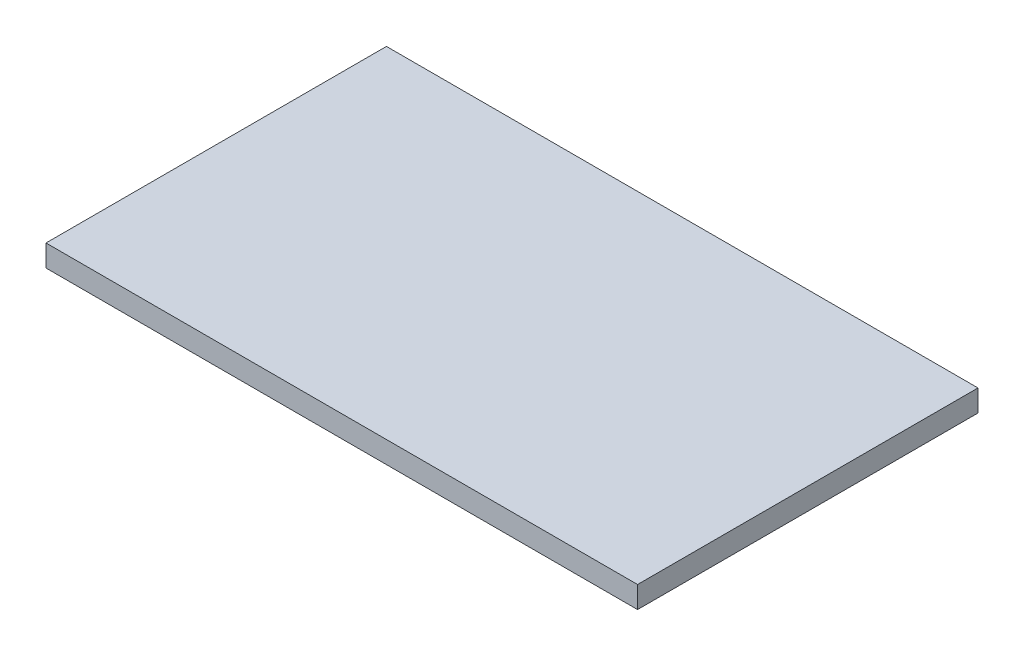
ISO-10303-21;
HEADER;
FILE_DESCRIPTION(('STEP AP214'),'2;1');
FILE_NAME('part.step','',(''),(''),'','','');
FILE_SCHEMA(('AUTOMOTIVE_DESIGN { 1 0 10303 214 1 1 1 1 }'));
ENDSEC;
DATA;
#1=APPLICATION_CONTEXT('core data for automotive mechanical design processes');
#2=APPLICATION_PROTOCOL_DEFINITION('international standard','automotive_design',2000,#1);
#3=PRODUCT_CONTEXT('',#1,'mechanical');
#4=PRODUCT('Part','Part','',(#3));
#5=PRODUCT_RELATED_PRODUCT_CATEGORY('part','',(#4));
#6=PRODUCT_DEFINITION_FORMATION('','',#4);
#7=PRODUCT_DEFINITION_CONTEXT('part definition',#1,'design');
#8=PRODUCT_DEFINITION('design','',#6,#7);
#9=PRODUCT_DEFINITION_SHAPE('','',#8);
#10=(LENGTH_UNIT() NAMED_UNIT(*) SI_UNIT(.MILLI.,.METRE.));
#11=(NAMED_UNIT(*) PLANE_ANGLE_UNIT() SI_UNIT($,.RADIAN.));
#12=(NAMED_UNIT(*) SI_UNIT($,.STERADIAN.) SOLID_ANGLE_UNIT());
#13=UNCERTAINTY_MEASURE_WITH_UNIT(LENGTH_MEASURE(1.E-05),#10,'distance_accuracy_value','');
#14=(GEOMETRIC_REPRESENTATION_CONTEXT(3) GLOBAL_UNCERTAINTY_ASSIGNED_CONTEXT((#13)) GLOBAL_UNIT_ASSIGNED_CONTEXT((#10,
#11,#12)) REPRESENTATION_CONTEXT('',''));
#15=CARTESIAN_POINT('',(0.,0.,0.));
#16=DIRECTION('',(0.,0.,1.));
#17=DIRECTION('',(1.,0.,0.));
#18=AXIS2_PLACEMENT_3D('',#15,#16,#17);
#19=CARTESIAN_POINT('',(-245.,18.,141.));
#20=DIRECTION('',(1.,0.,0.));
#21=DIRECTION('',(0.,0.,-1.));
#22=AXIS2_PLACEMENT_3D('',#19,#20,#21);
#23=PLANE('',#22);
#24=DIRECTION('',(0.,0.,1.));
#25=VECTOR('',#24,1.);
#26=CARTESIAN_POINT('',(-245.,0.,141.));
#27=LINE('',#26,#25);
#28=CARTESIAN_POINT('',(-245.,0.,-141.));
#29=VERTEX_POINT('',#28);
#30=CARTESIAN_POINT('',(-245.,0.,141.));
#31=VERTEX_POINT('',#30);
#32=EDGE_CURVE('E98',#29,#31,#27,.T.);
#33=ORIENTED_EDGE('',*,*,#32,.T.);
#34=DIRECTION('',(0.,-1.,0.));
#35=VECTOR('',#34,1.);
#36=CARTESIAN_POINT('',(-245.,18.,141.));
#37=LINE('',#36,#35);
#38=CARTESIAN_POINT('',(-245.,18.,141.));
#39=VERTEX_POINT('',#38);
#40=EDGE_CURVE('E11',#39,#31,#37,.T.);
#41=ORIENTED_EDGE('',*,*,#40,.F.);
#42=DIRECTION('',(0.,0.,1.));
#43=VECTOR('',#42,1.);
#44=CARTESIAN_POINT('',(-245.,18.,141.));
#45=LINE('',#44,#43);
#46=CARTESIAN_POINT('',(-245.,18.,-141.));
#47=VERTEX_POINT('',#46);
#48=EDGE_CURVE('E86',#47,#39,#45,.T.);
#49=ORIENTED_EDGE('',*,*,#48,.F.);
#50=DIRECTION('',(0.,-1.,0.));
#51=VECTOR('',#50,1.);
#52=CARTESIAN_POINT('',(-245.,18.,-141.));
#53=LINE('',#52,#51);
#54=EDGE_CURVE('E94',#47,#29,#53,.T.);
#55=ORIENTED_EDGE('',*,*,#54,.T.);
#56=EDGE_LOOP('',(#33,#41,#49,#55));
#57=FACE_BOUND('',#56,.T.);
#58=ADVANCED_FACE('F35',(#57),#23,.F.);
#59=CARTESIAN_POINT('',(245.,18.,141.));
#60=DIRECTION('',(0.,0.,-1.));
#61=DIRECTION('',(-1.,0.,0.));
#62=AXIS2_PLACEMENT_3D('',#59,#60,#61);
#63=PLANE('',#62);
#64=DIRECTION('',(1.,0.,0.));
#65=VECTOR('',#64,1.);
#66=CARTESIAN_POINT('',(245.,0.,141.));
#67=LINE('',#66,#65);
#68=CARTESIAN_POINT('',(245.,0.,141.));
#69=VERTEX_POINT('',#68);
#70=EDGE_CURVE('E90',#31,#69,#67,.T.);
#71=ORIENTED_EDGE('',*,*,#70,.T.);
#72=DIRECTION('',(0.,-1.,0.));
#73=VECTOR('',#72,1.);
#74=CARTESIAN_POINT('',(245.,18.,141.));
#75=LINE('',#74,#73);
#76=CARTESIAN_POINT('',(245.,18.,141.));
#77=VERTEX_POINT('',#76);
#78=EDGE_CURVE('E43',#77,#69,#75,.T.);
#79=ORIENTED_EDGE('',*,*,#78,.F.);
#80=DIRECTION('',(1.,0.,0.));
#81=VECTOR('',#80,1.);
#82=CARTESIAN_POINT('',(245.,18.,141.));
#83=LINE('',#82,#81);
#84=EDGE_CURVE('E81',#39,#77,#83,.T.);
#85=ORIENTED_EDGE('',*,*,#84,.F.);
#86=ORIENTED_EDGE('',*,*,#40,.T.);
#87=EDGE_LOOP('',(#71,#79,#85,#86));
#88=FACE_BOUND('',#87,.T.);
#89=ADVANCED_FACE('F89',(#88),#63,.F.);
#90=CARTESIAN_POINT('',(245.,18.,141.));
#91=DIRECTION('',(-1.,0.,0.));
#92=DIRECTION('',(0.,0.,1.));
#93=AXIS2_PLACEMENT_3D('',#90,#91,#92);
#94=PLANE('',#93);
#95=DIRECTION('',(0.,0.,-1.));
#96=VECTOR('',#95,1.);
#97=CARTESIAN_POINT('',(245.,0.,141.));
#98=LINE('',#97,#96);
#99=CARTESIAN_POINT('',(245.,0.,-141.));
#100=VERTEX_POINT('',#99);
#101=EDGE_CURVE('E68',#69,#100,#98,.T.);
#102=ORIENTED_EDGE('',*,*,#101,.T.);
#103=DIRECTION('',(0.,-1.,0.));
#104=VECTOR('',#103,1.);
#105=CARTESIAN_POINT('',(245.,18.,-141.));
#106=LINE('',#105,#104);
#107=CARTESIAN_POINT('',(245.,18.,-141.));
#108=VERTEX_POINT('',#107);
#109=EDGE_CURVE('E91',#108,#100,#106,.T.);
#110=ORIENTED_EDGE('',*,*,#109,.F.);
#111=DIRECTION('',(0.,0.,-1.));
#112=VECTOR('',#111,1.);
#113=CARTESIAN_POINT('',(245.,18.,141.));
#114=LINE('',#113,#112);
#115=EDGE_CURVE('E84',#77,#108,#114,.T.);
#116=ORIENTED_EDGE('',*,*,#115,.F.);
#117=ORIENTED_EDGE('',*,*,#78,.T.);
#118=EDGE_LOOP('',(#102,#110,#116,#117));
#119=FACE_BOUND('',#118,.T.);
#120=ADVANCED_FACE('F92',(#119),#94,.F.);
#121=CARTESIAN_POINT('',(245.,18.,-141.));
#122=DIRECTION('',(0.,0.,1.));
#123=DIRECTION('',(1.,0.,0.));
#124=AXIS2_PLACEMENT_3D('',#121,#122,#123);
#125=PLANE('',#124);
#126=DIRECTION('',(-1.,0.,0.));
#127=VECTOR('',#126,1.);
#128=CARTESIAN_POINT('',(245.,0.,-141.));
#129=LINE('',#128,#127);
#130=EDGE_CURVE('E74',#100,#29,#129,.T.);
#131=ORIENTED_EDGE('',*,*,#130,.T.);
#132=ORIENTED_EDGE('',*,*,#54,.F.);
#133=DIRECTION('',(-1.,0.,0.));
#134=VECTOR('',#133,1.);
#135=CARTESIAN_POINT('',(245.,18.,-141.));
#136=LINE('',#135,#134);
#137=EDGE_CURVE('E51',#108,#47,#136,.T.);
#138=ORIENTED_EDGE('',*,*,#137,.F.);
#139=ORIENTED_EDGE('',*,*,#109,.T.);
#140=EDGE_LOOP('',(#131,#132,#138,#139));
#141=FACE_BOUND('',#140,.T.);
#142=ADVANCED_FACE('F105',(#141),#125,.F.);
#143=CARTESIAN_POINT('',(0.,18.,0.));
#144=DIRECTION('',(0.,1.,0.));
#145=DIRECTION('',(0.,0.,1.));
#146=AXIS2_PLACEMENT_3D('',#143,#144,#145);
#147=PLANE('',#146);
#148=ORIENTED_EDGE('',*,*,#48,.T.);
#149=ORIENTED_EDGE('',*,*,#84,.T.);
#150=ORIENTED_EDGE('',*,*,#115,.T.);
#151=ORIENTED_EDGE('',*,*,#137,.T.);
#152=EDGE_LOOP('',(#148,#149,#150,#151));
#153=FACE_BOUND('',#152,.T.);
#154=ADVANCED_FACE('F82',(#153),#147,.T.);
#155=CARTESIAN_POINT('',(0.,0.,0.));
#156=DIRECTION('',(0.,1.,0.));
#157=DIRECTION('',(0.,0.,1.));
#158=AXIS2_PLACEMENT_3D('',#155,#156,#157);
#159=PLANE('',#158);
#160=ORIENTED_EDGE('',*,*,#32,.F.);
#161=ORIENTED_EDGE('',*,*,#130,.F.);
#162=ORIENTED_EDGE('',*,*,#101,.F.);
#163=ORIENTED_EDGE('',*,*,#70,.F.);
#164=EDGE_LOOP('',(#160,#161,#162,#163));
#165=FACE_BOUND('',#164,.T.);
#166=ADVANCED_FACE('F108',(#165),#159,.F.);
#167=CLOSED_SHELL('',(#58,#89,#120,#142,#154,#166));
#168=MANIFOLD_SOLID_BREP('B2',#167);
#169=ADVANCED_BREP_SHAPE_REPRESENTATION('',(#18,#168),#14);
#170=SHAPE_DEFINITION_REPRESENTATION(#9,#169);
ENDSEC;
END-ISO-10303-21;
